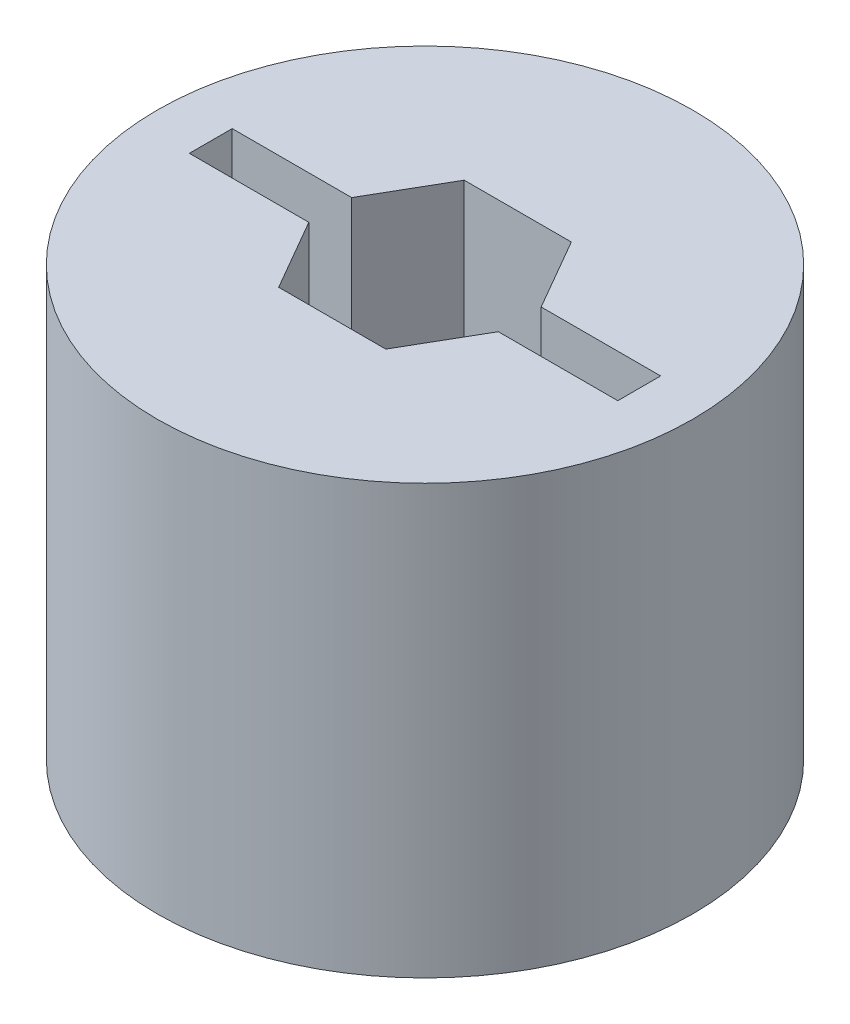
ISO-10303-21;
HEADER;
FILE_DESCRIPTION(('STEP AP214'),'2;1');
FILE_NAME('part.step','',(''),(''),'','','');
FILE_SCHEMA(('AUTOMOTIVE_DESIGN { 1 0 10303 214 1 1 1 1 }'));
ENDSEC;
DATA;
#1=APPLICATION_CONTEXT('core data for automotive mechanical design processes');
#2=APPLICATION_PROTOCOL_DEFINITION('international standard','automotive_design',2000,#1);
#3=PRODUCT_CONTEXT('',#1,'mechanical');
#4=PRODUCT('Part','Part','',(#3));
#5=PRODUCT_RELATED_PRODUCT_CATEGORY('part','',(#4));
#6=PRODUCT_DEFINITION_FORMATION('','',#4);
#7=PRODUCT_DEFINITION_CONTEXT('part definition',#1,'design');
#8=PRODUCT_DEFINITION('design','',#6,#7);
#9=PRODUCT_DEFINITION_SHAPE('','',#8);
#10=(LENGTH_UNIT() NAMED_UNIT(*) SI_UNIT(.MILLI.,.METRE.));
#11=(NAMED_UNIT(*) PLANE_ANGLE_UNIT() SI_UNIT($,.RADIAN.));
#12=(NAMED_UNIT(*) SI_UNIT($,.STERADIAN.) SOLID_ANGLE_UNIT());
#13=UNCERTAINTY_MEASURE_WITH_UNIT(LENGTH_MEASURE(1.E-05),#10,'distance_accuracy_value','');
#14=(GEOMETRIC_REPRESENTATION_CONTEXT(3) GLOBAL_UNCERTAINTY_ASSIGNED_CONTEXT((#13)) GLOBAL_UNIT_ASSIGNED_CONTEXT((#10,
#11,#12)) REPRESENTATION_CONTEXT('',''));
#15=CARTESIAN_POINT('',(0.,0.,0.));
#16=DIRECTION('',(0.,0.,1.));
#17=DIRECTION('',(1.,0.,0.));
#18=AXIS2_PLACEMENT_3D('',#15,#16,#17);
#19=CARTESIAN_POINT('',(0.,25.4,0.));
#20=DIRECTION('',(0.,-1.,0.));
#21=DIRECTION('',(0.,0.,-1.));
#22=AXIS2_PLACEMENT_3D('',#19,#20,#21);
#23=CYLINDRICAL_SURFACE('',#22,15.875);
#24=CARTESIAN_POINT('',(0.,25.4,0.));
#25=DIRECTION('',(0.,1.,0.));
#26=DIRECTION('',(0.,0.,1.));
#27=AXIS2_PLACEMENT_3D('',#24,#25,#26);
#28=CIRCLE('',#27,15.875);
#29=CARTESIAN_POINT('',(0.,25.4,15.875));
#30=VERTEX_POINT('',#29);
#31=EDGE_CURVE('E11',#30,#30,#28,.T.);
#32=ORIENTED_EDGE('',*,*,#31,.F.);
#33=EDGE_LOOP('',(#32));
#34=FACE_BOUND('',#33,.T.);
#35=CARTESIAN_POINT('',(0.,0.,0.));
#36=DIRECTION('',(0.,1.,0.));
#37=DIRECTION('',(0.,0.,1.));
#38=AXIS2_PLACEMENT_3D('',#35,#36,#37);
#39=CIRCLE('',#38,15.875);
#40=CARTESIAN_POINT('',(0.,0.,15.875));
#41=VERTEX_POINT('',#40);
#42=EDGE_CURVE('E36',#41,#41,#39,.T.);
#43=ORIENTED_EDGE('',*,*,#42,.T.);
#44=EDGE_LOOP('',(#43));
#45=FACE_BOUND('',#44,.T.);
#46=ADVANCED_FACE('F33',(#34,#45),#23,.T.);
#47=CARTESIAN_POINT('',(0.,25.4,0.));
#48=DIRECTION('',(0.,1.,0.));
#49=DIRECTION('',(0.,0.,1.));
#50=AXIS2_PLACEMENT_3D('',#47,#48,#49);
#51=PLANE('',#50);
#52=DIRECTION('',(1.,0.,0.));
#53=VECTOR('',#52,1.);
#54=CARTESIAN_POINT('',(0.,25.4,1.27));
#55=LINE('',#54,#53);
#56=CARTESIAN_POINT('',(-12.7,25.4,1.27));
#57=VERTEX_POINT('',#56);
#58=CARTESIAN_POINT('',(-5.61676515812917,25.4,1.27));
#59=VERTEX_POINT('',#58);
#60=EDGE_CURVE('E47',#57,#59,#55,.T.);
#61=ORIENTED_EDGE('',*,*,#60,.F.);
#62=DIRECTION('',(0.,0.,-1.));
#63=VECTOR('',#62,1.);
#64=CARTESIAN_POINT('',(-12.7,25.4,0.));
#65=LINE('',#64,#63);
#66=CARTESIAN_POINT('',(-12.7,25.4,-1.27));
#67=VERTEX_POINT('',#66);
#68=EDGE_CURVE('E139',#57,#67,#65,.T.);
#69=ORIENTED_EDGE('',*,*,#68,.T.);
#70=DIRECTION('',(1.,0.,0.));
#71=VECTOR('',#70,1.);
#72=CARTESIAN_POINT('',(0.,25.4,-1.27));
#73=LINE('',#72,#71);
#74=CARTESIAN_POINT('',(-5.61676515812917,25.4,-1.27));
#75=VERTEX_POINT('',#74);
#76=EDGE_CURVE('E142',#67,#75,#73,.T.);
#77=ORIENTED_EDGE('',*,*,#76,.T.);
#78=DIRECTION('',(-0.5,0.,0.866025403784439));
#79=VECTOR('',#78,1.);
#80=CARTESIAN_POINT('',(-4.7625,25.4,-2.74963065701559));
#81=LINE('',#80,#79);
#82=CARTESIAN_POINT('',(-3.175,25.4,-5.49926131403118));
#83=VERTEX_POINT('',#82);
#84=EDGE_CURVE('E193',#83,#75,#81,.T.);
#85=ORIENTED_EDGE('',*,*,#84,.F.);
#86=DIRECTION('',(-1.,0.,0.));
#87=VECTOR('',#86,1.);
#88=CARTESIAN_POINT('',(0.,25.4,-5.49926131403118));
#89=LINE('',#88,#87);
#90=CARTESIAN_POINT('',(3.175,25.4,-5.49926131403118));
#91=VERTEX_POINT('',#90);
#92=EDGE_CURVE('E190',#91,#83,#89,.T.);
#93=ORIENTED_EDGE('',*,*,#92,.F.);
#94=DIRECTION('',(-0.5,0.,-0.866025403784439));
#95=VECTOR('',#94,1.);
#96=CARTESIAN_POINT('',(4.7625,25.4,-2.74963065701559));
#97=LINE('',#96,#95);
#98=CARTESIAN_POINT('',(5.61676515812917,25.4,-1.27));
#99=VERTEX_POINT('',#98);
#100=EDGE_CURVE('E187',#99,#91,#97,.T.);
#101=ORIENTED_EDGE('',*,*,#100,.F.);
#102=DIRECTION('',(1.,0.,0.));
#103=VECTOR('',#102,1.);
#104=CARTESIAN_POINT('',(0.,25.4,-1.27));
#105=LINE('',#104,#103);
#106=CARTESIAN_POINT('',(12.7,25.4,-1.27));
#107=VERTEX_POINT('',#106);
#108=EDGE_CURVE('E184',#99,#107,#105,.T.);
#109=ORIENTED_EDGE('',*,*,#108,.T.);
#110=DIRECTION('',(0.,0.,-1.));
#111=VECTOR('',#110,1.);
#112=CARTESIAN_POINT('',(12.7,25.4,0.));
#113=LINE('',#112,#111);
#114=CARTESIAN_POINT('',(12.7,25.4,1.27));
#115=VERTEX_POINT('',#114);
#116=EDGE_CURVE('E181',#115,#107,#113,.T.);
#117=ORIENTED_EDGE('',*,*,#116,.F.);
#118=DIRECTION('',(1.,0.,0.));
#119=VECTOR('',#118,1.);
#120=CARTESIAN_POINT('',(0.,25.4,1.27));
#121=LINE('',#120,#119);
#122=CARTESIAN_POINT('',(5.61676515812917,25.4,1.27));
#123=VERTEX_POINT('',#122);
#124=EDGE_CURVE('E178',#123,#115,#121,.T.);
#125=ORIENTED_EDGE('',*,*,#124,.F.);
#126=DIRECTION('',(0.5,0.,-0.866025403784439));
#127=VECTOR('',#126,1.);
#128=CARTESIAN_POINT('',(4.7625,25.4,2.74963065701559));
#129=LINE('',#128,#127);
#130=CARTESIAN_POINT('',(3.175,25.4,5.49926131403118));
#131=VERTEX_POINT('',#130);
#132=EDGE_CURVE('E175',#131,#123,#129,.T.);
#133=ORIENTED_EDGE('',*,*,#132,.F.);
#134=DIRECTION('',(1.,0.,0.));
#135=VECTOR('',#134,1.);
#136=CARTESIAN_POINT('',(0.,25.4,5.49926131403118));
#137=LINE('',#136,#135);
#138=CARTESIAN_POINT('',(-3.175,25.4,5.49926131403118));
#139=VERTEX_POINT('',#138);
#140=EDGE_CURVE('E172',#139,#131,#137,.T.);
#141=ORIENTED_EDGE('',*,*,#140,.F.);
#142=DIRECTION('',(0.5,0.,0.866025403784439));
#143=VECTOR('',#142,1.);
#144=CARTESIAN_POINT('',(-4.7625,25.4,2.74963065701559));
#145=LINE('',#144,#143);
#146=EDGE_CURVE('E170',#59,#139,#145,.T.);
#147=ORIENTED_EDGE('',*,*,#146,.F.);
#148=EDGE_LOOP('',(#61,#69,#77,#85,#93,#101,#109,#117,#125,#133,#141,#147));
#149=FACE_BOUND('',#148,.T.);
#150=ORIENTED_EDGE('',*,*,#31,.T.);
#151=EDGE_LOOP('',(#150));
#152=FACE_BOUND('',#151,.T.);
#153=ADVANCED_FACE('F222',(#149,#152),#51,.T.);
#154=CARTESIAN_POINT('',(0.,0.,0.));
#155=DIRECTION('',(0.,1.,0.));
#156=DIRECTION('',(0.,0.,1.));
#157=AXIS2_PLACEMENT_3D('',#154,#155,#156);
#158=PLANE('',#157);
#159=DIRECTION('',(0.,0.,-1.));
#160=VECTOR('',#159,1.);
#161=CARTESIAN_POINT('',(-12.7,0.,0.));
#162=LINE('',#161,#160);
#163=CARTESIAN_POINT('',(-12.7,0.,1.27));
#164=VERTEX_POINT('',#163);
#165=CARTESIAN_POINT('',(-12.7,0.,-1.27));
#166=VERTEX_POINT('',#165);
#167=EDGE_CURVE('E129',#164,#166,#162,.T.);
#168=ORIENTED_EDGE('',*,*,#167,.F.);
#169=DIRECTION('',(1.,0.,0.));
#170=VECTOR('',#169,1.);
#171=CARTESIAN_POINT('',(0.,0.,1.27));
#172=LINE('',#171,#170);
#173=CARTESIAN_POINT('',(-5.61676515812917,0.,1.27));
#174=VERTEX_POINT('',#173);
#175=EDGE_CURVE('E123',#164,#174,#172,.T.);
#176=ORIENTED_EDGE('',*,*,#175,.T.);
#177=DIRECTION('',(0.5,0.,0.866025403784439));
#178=VECTOR('',#177,1.);
#179=CARTESIAN_POINT('',(-4.7625,0.,2.74963065701559));
#180=LINE('',#179,#178);
#181=CARTESIAN_POINT('',(-3.175,0.,5.49926131403118));
#182=VERTEX_POINT('',#181);
#183=EDGE_CURVE('E132',#174,#182,#180,.T.);
#184=ORIENTED_EDGE('',*,*,#183,.T.);
#185=DIRECTION('',(1.,0.,0.));
#186=VECTOR('',#185,1.);
#187=CARTESIAN_POINT('',(0.,0.,5.49926131403118));
#188=LINE('',#187,#186);
#189=CARTESIAN_POINT('',(3.175,0.,5.49926131403118));
#190=VERTEX_POINT('',#189);
#191=EDGE_CURVE('E55',#182,#190,#188,.T.);
#192=ORIENTED_EDGE('',*,*,#191,.T.);
#193=DIRECTION('',(0.5,0.,-0.866025403784439));
#194=VECTOR('',#193,1.);
#195=CARTESIAN_POINT('',(4.7625,0.,2.74963065701559));
#196=LINE('',#195,#194);
#197=CARTESIAN_POINT('',(5.61676515812917,0.,1.27));
#198=VERTEX_POINT('',#197);
#199=EDGE_CURVE('E146',#190,#198,#196,.T.);
#200=ORIENTED_EDGE('',*,*,#199,.T.);
#201=DIRECTION('',(1.,0.,0.));
#202=VECTOR('',#201,1.);
#203=CARTESIAN_POINT('',(0.,0.,1.27));
#204=LINE('',#203,#202);
#205=CARTESIAN_POINT('',(12.7,0.,1.27));
#206=VERTEX_POINT('',#205);
#207=EDGE_CURVE('E149',#198,#206,#204,.T.);
#208=ORIENTED_EDGE('',*,*,#207,.T.);
#209=DIRECTION('',(0.,0.,-1.));
#210=VECTOR('',#209,1.);
#211=CARTESIAN_POINT('',(12.7,0.,0.));
#212=LINE('',#211,#210);
#213=CARTESIAN_POINT('',(12.7,0.,-1.27));
#214=VERTEX_POINT('',#213);
#215=EDGE_CURVE('E152',#206,#214,#212,.T.);
#216=ORIENTED_EDGE('',*,*,#215,.T.);
#217=DIRECTION('',(1.,0.,0.));
#218=VECTOR('',#217,1.);
#219=CARTESIAN_POINT('',(0.,0.,-1.27));
#220=LINE('',#219,#218);
#221=CARTESIAN_POINT('',(5.61676515812917,0.,-1.27));
#222=VERTEX_POINT('',#221);
#223=EDGE_CURVE('E155',#222,#214,#220,.T.);
#224=ORIENTED_EDGE('',*,*,#223,.F.);
#225=DIRECTION('',(-0.5,0.,-0.866025403784439));
#226=VECTOR('',#225,1.);
#227=CARTESIAN_POINT('',(4.7625,0.,-2.74963065701559));
#228=LINE('',#227,#226);
#229=CARTESIAN_POINT('',(3.175,0.,-5.49926131403118));
#230=VERTEX_POINT('',#229);
#231=EDGE_CURVE('E157',#222,#230,#228,.T.);
#232=ORIENTED_EDGE('',*,*,#231,.T.);
#233=DIRECTION('',(-1.,0.,0.));
#234=VECTOR('',#233,1.);
#235=CARTESIAN_POINT('',(0.,0.,-5.49926131403118));
#236=LINE('',#235,#234);
#237=CARTESIAN_POINT('',(-3.175,0.,-5.49926131403118));
#238=VERTEX_POINT('',#237);
#239=EDGE_CURVE('E160',#230,#238,#236,.T.);
#240=ORIENTED_EDGE('',*,*,#239,.T.);
#241=DIRECTION('',(-0.5,0.,0.866025403784439));
#242=VECTOR('',#241,1.);
#243=CARTESIAN_POINT('',(-4.7625,0.,-2.74963065701559));
#244=LINE('',#243,#242);
#245=CARTESIAN_POINT('',(-5.61676515812917,0.,-1.27));
#246=VERTEX_POINT('',#245);
#247=EDGE_CURVE('E163',#238,#246,#244,.T.);
#248=ORIENTED_EDGE('',*,*,#247,.T.);
#249=DIRECTION('',(1.,0.,0.));
#250=VECTOR('',#249,1.);
#251=CARTESIAN_POINT('',(0.,0.,-1.27));
#252=LINE('',#251,#250);
#253=EDGE_CURVE('E166',#166,#246,#252,.T.);
#254=ORIENTED_EDGE('',*,*,#253,.F.);
#255=EDGE_LOOP('',(#168,#176,#184,#192,#200,#208,#216,#224,#232,#240,#248,#254));
#256=FACE_BOUND('',#255,.T.);
#257=ORIENTED_EDGE('',*,*,#42,.F.);
#258=EDGE_LOOP('',(#257));
#259=FACE_BOUND('',#258,.T.);
#260=ADVANCED_FACE('F136',(#256,#259),#158,.F.);
#261=CARTESIAN_POINT('',(0.,0.,1.27));
#262=DIRECTION('',(0.,0.,1.));
#263=DIRECTION('',(1.,0.,0.));
#264=AXIS2_PLACEMENT_3D('',#261,#262,#263);
#265=PLANE('',#264);
#266=ORIENTED_EDGE('',*,*,#60,.T.);
#267=DIRECTION('',(0.,1.,0.));
#268=VECTOR('',#267,1.);
#269=CARTESIAN_POINT('',(-5.61676515812917,0.,1.27));
#270=LINE('',#269,#268);
#271=EDGE_CURVE('E119',#174,#59,#270,.T.);
#272=ORIENTED_EDGE('',*,*,#271,.F.);
#273=ORIENTED_EDGE('',*,*,#175,.F.);
#274=DIRECTION('',(0.,1.,0.));
#275=VECTOR('',#274,1.);
#276=CARTESIAN_POINT('',(-12.7,0.,1.27));
#277=LINE('',#276,#275);
#278=EDGE_CURVE('E198',#164,#57,#277,.T.);
#279=ORIENTED_EDGE('',*,*,#278,.T.);
#280=EDGE_LOOP('',(#266,#272,#273,#279));
#281=FACE_BOUND('',#280,.T.);
#282=ADVANCED_FACE('F121',(#281),#265,.F.);
#283=CARTESIAN_POINT('',(-12.7,0.,0.));
#284=DIRECTION('',(1.,0.,0.));
#285=DIRECTION('',(0.,0.,-1.));
#286=AXIS2_PLACEMENT_3D('',#283,#284,#285);
#287=PLANE('',#286);
#288=ORIENTED_EDGE('',*,*,#68,.F.);
#289=ORIENTED_EDGE('',*,*,#278,.F.);
#290=ORIENTED_EDGE('',*,*,#167,.T.);
#291=DIRECTION('',(0.,1.,0.));
#292=VECTOR('',#291,1.);
#293=CARTESIAN_POINT('',(-12.7,0.,-1.27));
#294=LINE('',#293,#292);
#295=EDGE_CURVE('E200',#166,#67,#294,.T.);
#296=ORIENTED_EDGE('',*,*,#295,.T.);
#297=EDGE_LOOP('',(#288,#289,#290,#296));
#298=FACE_BOUND('',#297,.T.);
#299=ADVANCED_FACE('F259',(#298),#287,.T.);
#300=CARTESIAN_POINT('',(0.,0.,-1.27));
#301=DIRECTION('',(0.,0.,1.));
#302=DIRECTION('',(1.,0.,0.));
#303=AXIS2_PLACEMENT_3D('',#300,#301,#302);
#304=PLANE('',#303);
#305=ORIENTED_EDGE('',*,*,#76,.F.);
#306=ORIENTED_EDGE('',*,*,#295,.F.);
#307=ORIENTED_EDGE('',*,*,#253,.T.);
#308=DIRECTION('',(0.,1.,0.));
#309=VECTOR('',#308,1.);
#310=CARTESIAN_POINT('',(-5.61676515812917,0.,-1.27));
#311=LINE('',#310,#309);
#312=EDGE_CURVE('E202',#246,#75,#311,.T.);
#313=ORIENTED_EDGE('',*,*,#312,.T.);
#314=EDGE_LOOP('',(#305,#306,#307,#313));
#315=FACE_BOUND('',#314,.T.);
#316=ADVANCED_FACE('F256',(#315),#304,.T.);
#317=CARTESIAN_POINT('',(-4.7625,0.,-2.74963065701559));
#318=DIRECTION('',(-0.866025403784439,0.,-0.5));
#319=DIRECTION('',(-0.5,0.,0.866025403784439));
#320=AXIS2_PLACEMENT_3D('',#317,#318,#319);
#321=PLANE('',#320);
#322=ORIENTED_EDGE('',*,*,#84,.T.);
#323=ORIENTED_EDGE('',*,*,#312,.F.);
#324=ORIENTED_EDGE('',*,*,#247,.F.);
#325=DIRECTION('',(0.,1.,0.));
#326=VECTOR('',#325,1.);
#327=CARTESIAN_POINT('',(-3.175,0.,-5.49926131403118));
#328=LINE('',#327,#326);
#329=EDGE_CURVE('E204',#238,#83,#328,.T.);
#330=ORIENTED_EDGE('',*,*,#329,.T.);
#331=EDGE_LOOP('',(#322,#323,#324,#330));
#332=FACE_BOUND('',#331,.T.);
#333=ADVANCED_FACE('F252',(#332),#321,.F.);
#334=CARTESIAN_POINT('',(0.,0.,-5.49926131403118));
#335=DIRECTION('',(0.,0.,-1.));
#336=DIRECTION('',(-1.,0.,0.));
#337=AXIS2_PLACEMENT_3D('',#334,#335,#336);
#338=PLANE('',#337);
#339=ORIENTED_EDGE('',*,*,#92,.T.);
#340=ORIENTED_EDGE('',*,*,#329,.F.);
#341=ORIENTED_EDGE('',*,*,#239,.F.);
#342=DIRECTION('',(0.,1.,0.));
#343=VECTOR('',#342,1.);
#344=CARTESIAN_POINT('',(3.175,0.,-5.49926131403118));
#345=LINE('',#344,#343);
#346=EDGE_CURVE('E206',#230,#91,#345,.T.);
#347=ORIENTED_EDGE('',*,*,#346,.T.);
#348=EDGE_LOOP('',(#339,#340,#341,#347));
#349=FACE_BOUND('',#348,.T.);
#350=ADVANCED_FACE('F247',(#349),#338,.F.);
#351=CARTESIAN_POINT('',(4.7625,0.,-2.74963065701559));
#352=DIRECTION('',(0.866025403784438,0.,-0.5));
#353=DIRECTION('',(-0.5,0.,-0.866025403784439));
#354=AXIS2_PLACEMENT_3D('',#351,#352,#353);
#355=PLANE('',#354);
#356=ORIENTED_EDGE('',*,*,#100,.T.);
#357=ORIENTED_EDGE('',*,*,#346,.F.);
#358=ORIENTED_EDGE('',*,*,#231,.F.);
#359=DIRECTION('',(0.,1.,0.));
#360=VECTOR('',#359,1.);
#361=CARTESIAN_POINT('',(5.61676515812917,0.,-1.27));
#362=LINE('',#361,#360);
#363=EDGE_CURVE('E208',#222,#99,#362,.T.);
#364=ORIENTED_EDGE('',*,*,#363,.T.);
#365=EDGE_LOOP('',(#356,#357,#358,#364));
#366=FACE_BOUND('',#365,.T.);
#367=ADVANCED_FACE('F244',(#366),#355,.F.);
#368=CARTESIAN_POINT('',(0.,0.,-1.27));
#369=DIRECTION('',(0.,0.,1.));
#370=DIRECTION('',(1.,0.,0.));
#371=AXIS2_PLACEMENT_3D('',#368,#369,#370);
#372=PLANE('',#371);
#373=ORIENTED_EDGE('',*,*,#108,.F.);
#374=ORIENTED_EDGE('',*,*,#363,.F.);
#375=ORIENTED_EDGE('',*,*,#223,.T.);
#376=DIRECTION('',(0.,1.,0.));
#377=VECTOR('',#376,1.);
#378=CARTESIAN_POINT('',(12.7,0.,-1.27));
#379=LINE('',#378,#377);
#380=EDGE_CURVE('E210',#214,#107,#379,.T.);
#381=ORIENTED_EDGE('',*,*,#380,.T.);
#382=EDGE_LOOP('',(#373,#374,#375,#381));
#383=FACE_BOUND('',#382,.T.);
#384=ADVANCED_FACE('F239',(#383),#372,.T.);
#385=CARTESIAN_POINT('',(12.7,0.,0.));
#386=DIRECTION('',(1.,0.,0.));
#387=DIRECTION('',(0.,0.,-1.));
#388=AXIS2_PLACEMENT_3D('',#385,#386,#387);
#389=PLANE('',#388);
#390=ORIENTED_EDGE('',*,*,#116,.T.);
#391=ORIENTED_EDGE('',*,*,#380,.F.);
#392=ORIENTED_EDGE('',*,*,#215,.F.);
#393=DIRECTION('',(0.,1.,0.));
#394=VECTOR('',#393,1.);
#395=CARTESIAN_POINT('',(12.7,0.,1.27));
#396=LINE('',#395,#394);
#397=EDGE_CURVE('E212',#206,#115,#396,.T.);
#398=ORIENTED_EDGE('',*,*,#397,.T.);
#399=EDGE_LOOP('',(#390,#391,#392,#398));
#400=FACE_BOUND('',#399,.T.);
#401=ADVANCED_FACE('F236',(#400),#389,.F.);
#402=CARTESIAN_POINT('',(0.,0.,1.27));
#403=DIRECTION('',(0.,0.,1.));
#404=DIRECTION('',(1.,0.,0.));
#405=AXIS2_PLACEMENT_3D('',#402,#403,#404);
#406=PLANE('',#405);
#407=ORIENTED_EDGE('',*,*,#124,.T.);
#408=ORIENTED_EDGE('',*,*,#397,.F.);
#409=ORIENTED_EDGE('',*,*,#207,.F.);
#410=DIRECTION('',(0.,1.,0.));
#411=VECTOR('',#410,1.);
#412=CARTESIAN_POINT('',(5.61676515812917,0.,1.27));
#413=LINE('',#412,#411);
#414=EDGE_CURVE('E214',#198,#123,#413,.T.);
#415=ORIENTED_EDGE('',*,*,#414,.T.);
#416=EDGE_LOOP('',(#407,#408,#409,#415));
#417=FACE_BOUND('',#416,.T.);
#418=ADVANCED_FACE('F233',(#417),#406,.F.);
#419=CARTESIAN_POINT('',(4.7625,0.,2.74963065701559));
#420=DIRECTION('',(0.866025403784439,0.,0.5));
#421=DIRECTION('',(0.5,0.,-0.866025403784439));
#422=AXIS2_PLACEMENT_3D('',#419,#420,#421);
#423=PLANE('',#422);
#424=ORIENTED_EDGE('',*,*,#132,.T.);
#425=ORIENTED_EDGE('',*,*,#414,.F.);
#426=ORIENTED_EDGE('',*,*,#199,.F.);
#427=DIRECTION('',(0.,1.,0.));
#428=VECTOR('',#427,1.);
#429=CARTESIAN_POINT('',(3.175,0.,5.49926131403118));
#430=LINE('',#429,#428);
#431=EDGE_CURVE('E216',#190,#131,#430,.T.);
#432=ORIENTED_EDGE('',*,*,#431,.T.);
#433=EDGE_LOOP('',(#424,#425,#426,#432));
#434=FACE_BOUND('',#433,.T.);
#435=ADVANCED_FACE('F227',(#434),#423,.F.);
#436=CARTESIAN_POINT('',(0.,0.,5.49926131403118));
#437=DIRECTION('',(0.,0.,1.));
#438=DIRECTION('',(1.,0.,0.));
#439=AXIS2_PLACEMENT_3D('',#436,#437,#438);
#440=PLANE('',#439);
#441=ORIENTED_EDGE('',*,*,#140,.T.);
#442=ORIENTED_EDGE('',*,*,#431,.F.);
#443=ORIENTED_EDGE('',*,*,#191,.F.);
#444=DIRECTION('',(0.,1.,0.));
#445=VECTOR('',#444,1.);
#446=CARTESIAN_POINT('',(-3.175,0.,5.49926131403118));
#447=LINE('',#446,#445);
#448=EDGE_CURVE('E128',#182,#139,#447,.T.);
#449=ORIENTED_EDGE('',*,*,#448,.T.);
#450=EDGE_LOOP('',(#441,#442,#443,#449));
#451=FACE_BOUND('',#450,.T.);
#452=ADVANCED_FACE('F218',(#451),#440,.F.);
#453=CARTESIAN_POINT('',(-4.7625,0.,2.74963065701559));
#454=DIRECTION('',(-0.866025403784439,0.,0.5));
#455=DIRECTION('',(0.5,0.,0.866025403784439));
#456=AXIS2_PLACEMENT_3D('',#453,#454,#455);
#457=PLANE('',#456);
#458=ORIENTED_EDGE('',*,*,#146,.T.);
#459=ORIENTED_EDGE('',*,*,#448,.F.);
#460=ORIENTED_EDGE('',*,*,#183,.F.);
#461=ORIENTED_EDGE('',*,*,#271,.T.);
#462=EDGE_LOOP('',(#458,#459,#460,#461));
#463=FACE_BOUND('',#462,.T.);
#464=ADVANCED_FACE('F133',(#463),#457,.F.);
#465=CLOSED_SHELL('',(#46,#153,#260,#282,#299,#316,#333,#350,#367,#384,#401,#418,#435,#452,#464));
#466=MANIFOLD_SOLID_BREP('B2',#465);
#467=ADVANCED_BREP_SHAPE_REPRESENTATION('',(#18,#466),#14);
#468=SHAPE_DEFINITION_REPRESENTATION(#9,#467);
ENDSEC;
END-ISO-10303-21;
